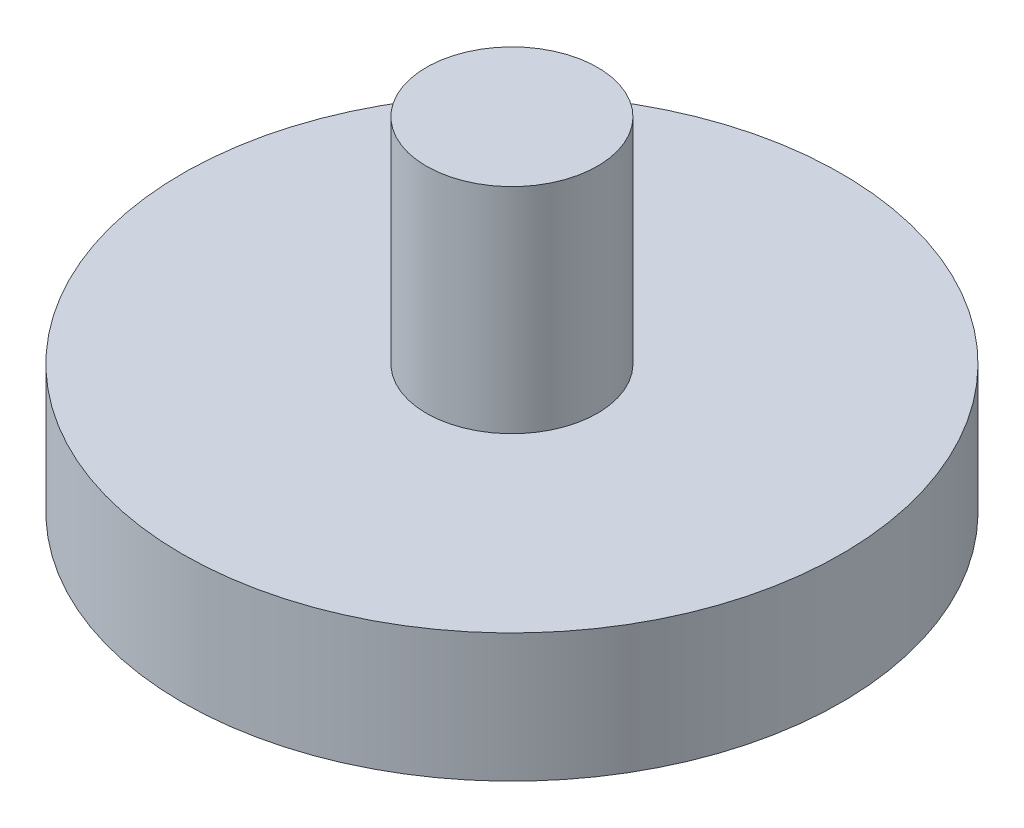
ISO-10303-21;
HEADER;
FILE_DESCRIPTION(('STEP AP214'),'2;1');
FILE_NAME('part.step','',(''),(''),'','','');
FILE_SCHEMA(('AUTOMOTIVE_DESIGN { 1 0 10303 214 1 1 1 1 }'));
ENDSEC;
DATA;
#1=APPLICATION_CONTEXT('core data for automotive mechanical design processes');
#2=APPLICATION_PROTOCOL_DEFINITION('international standard','automotive_design',2000,#1);
#3=PRODUCT_CONTEXT('',#1,'mechanical');
#4=PRODUCT('Part','Part','',(#3));
#5=PRODUCT_RELATED_PRODUCT_CATEGORY('part','',(#4));
#6=PRODUCT_DEFINITION_FORMATION('','',#4);
#7=PRODUCT_DEFINITION_CONTEXT('part definition',#1,'design');
#8=PRODUCT_DEFINITION('design','',#6,#7);
#9=PRODUCT_DEFINITION_SHAPE('','',#8);
#10=(LENGTH_UNIT() NAMED_UNIT(*) SI_UNIT(.MILLI.,.METRE.));
#11=(NAMED_UNIT(*) PLANE_ANGLE_UNIT() SI_UNIT($,.RADIAN.));
#12=(NAMED_UNIT(*) SI_UNIT($,.STERADIAN.) SOLID_ANGLE_UNIT());
#13=UNCERTAINTY_MEASURE_WITH_UNIT(LENGTH_MEASURE(1.E-05),#10,'distance_accuracy_value','');
#14=(GEOMETRIC_REPRESENTATION_CONTEXT(3) GLOBAL_UNCERTAINTY_ASSIGNED_CONTEXT((#13)) GLOBAL_UNIT_ASSIGNED_CONTEXT((#10,
#11,#12)) REPRESENTATION_CONTEXT('',''));
#15=CARTESIAN_POINT('',(0.,0.,0.));
#16=DIRECTION('',(0.,0.,1.));
#17=DIRECTION('',(1.,0.,0.));
#18=AXIS2_PLACEMENT_3D('',#15,#16,#17);
#19=CARTESIAN_POINT('',(0.,3.,0.));
#20=DIRECTION('',(0.,-1.,0.));
#21=DIRECTION('',(0.,0.,-1.));
#22=AXIS2_PLACEMENT_3D('',#19,#20,#21);
#23=CYLINDRICAL_SURFACE('',#22,7.7);
#24=CARTESIAN_POINT('',(0.,3.,0.));
#25=DIRECTION('',(0.,1.,0.));
#26=DIRECTION('',(0.,0.,1.));
#27=AXIS2_PLACEMENT_3D('',#24,#25,#26);
#28=CIRCLE('',#27,7.7);
#29=CARTESIAN_POINT('',(0.,3.,7.7));
#30=VERTEX_POINT('',#29);
#31=EDGE_CURVE('E39',#30,#30,#28,.T.);
#32=ORIENTED_EDGE('',*,*,#31,.F.);
#33=EDGE_LOOP('',(#32));
#34=FACE_BOUND('',#33,.T.);
#35=CARTESIAN_POINT('',(0.,0.,0.));
#36=DIRECTION('',(0.,1.,0.));
#37=DIRECTION('',(0.,0.,1.));
#38=AXIS2_PLACEMENT_3D('',#35,#36,#37);
#39=CIRCLE('',#38,7.7);
#40=CARTESIAN_POINT('',(0.,0.,7.7));
#41=VERTEX_POINT('',#40);
#42=EDGE_CURVE('E35',#41,#41,#39,.T.);
#43=ORIENTED_EDGE('',*,*,#42,.T.);
#44=EDGE_LOOP('',(#43));
#45=FACE_BOUND('',#44,.T.);
#46=ADVANCED_FACE('F32',(#34,#45),#23,.T.);
#47=CARTESIAN_POINT('',(0.,3.,0.));
#48=DIRECTION('',(0.,1.,0.));
#49=DIRECTION('',(0.,0.,1.));
#50=AXIS2_PLACEMENT_3D('',#47,#48,#49);
#51=PLANE('',#50);
#52=CARTESIAN_POINT('',(0.,3.,0.));
#53=DIRECTION('',(0.,1.,0.));
#54=DIRECTION('',(0.,0.,1.));
#55=AXIS2_PLACEMENT_3D('',#52,#53,#54);
#56=CIRCLE('',#55,2.);
#57=CARTESIAN_POINT('',(0.,3.,2.));
#58=VERTEX_POINT('',#57);
#59=EDGE_CURVE('E10',#58,#58,#56,.T.);
#60=ORIENTED_EDGE('',*,*,#59,.F.);
#61=EDGE_LOOP('',(#60));
#62=FACE_BOUND('',#61,.T.);
#63=ORIENTED_EDGE('',*,*,#31,.T.);
#64=EDGE_LOOP('',(#63));
#65=FACE_BOUND('',#64,.T.);
#66=ADVANCED_FACE('F68',(#62,#65),#51,.T.);
#67=CARTESIAN_POINT('',(0.,0.,0.));
#68=DIRECTION('',(0.,1.,0.));
#69=DIRECTION('',(0.,0.,1.));
#70=AXIS2_PLACEMENT_3D('',#67,#68,#69);
#71=PLANE('',#70);
#72=CARTESIAN_POINT('',(0.,0.,0.));
#73=DIRECTION('',(0.,-1.,0.));
#74=DIRECTION('',(0.,0.,-1.));
#75=AXIS2_PLACEMENT_3D('',#72,#73,#74);
#76=CIRCLE('',#75,1.5);
#77=CARTESIAN_POINT('',(0.,0.,-1.5));
#78=VERTEX_POINT('',#77);
#79=EDGE_CURVE('E49',#78,#78,#76,.T.);
#80=ORIENTED_EDGE('',*,*,#79,.F.);
#81=EDGE_LOOP('',(#80));
#82=FACE_BOUND('',#81,.T.);
#83=ORIENTED_EDGE('',*,*,#42,.F.);
#84=EDGE_LOOP('',(#83));
#85=FACE_BOUND('',#84,.T.);
#86=ADVANCED_FACE('F64',(#82,#85),#71,.F.);
#87=CARTESIAN_POINT('',(0.,8.,0.));
#88=DIRECTION('',(0.,-1.,0.));
#89=DIRECTION('',(0.,0.,-1.));
#90=AXIS2_PLACEMENT_3D('',#87,#88,#89);
#91=CYLINDRICAL_SURFACE('',#90,2.);
#92=CARTESIAN_POINT('',(0.,8.,0.));
#93=DIRECTION('',(0.,1.,0.));
#94=DIRECTION('',(0.,0.,1.));
#95=AXIS2_PLACEMENT_3D('',#92,#93,#94);
#96=CIRCLE('',#95,2.);
#97=CARTESIAN_POINT('',(0.,8.,2.));
#98=VERTEX_POINT('',#97);
#99=EDGE_CURVE('E45',#98,#98,#96,.T.);
#100=ORIENTED_EDGE('',*,*,#99,.F.);
#101=EDGE_LOOP('',(#100));
#102=FACE_BOUND('',#101,.T.);
#103=ORIENTED_EDGE('',*,*,#59,.T.);
#104=EDGE_LOOP('',(#103));
#105=FACE_BOUND('',#104,.T.);
#106=ADVANCED_FACE('F67',(#102,#105),#91,.T.);
#107=CARTESIAN_POINT('',(0.,8.,0.));
#108=DIRECTION('',(0.,1.,0.));
#109=DIRECTION('',(0.,0.,1.));
#110=AXIS2_PLACEMENT_3D('',#107,#108,#109);
#111=PLANE('',#110);
#112=ORIENTED_EDGE('',*,*,#99,.T.);
#113=EDGE_LOOP('',(#112));
#114=FACE_BOUND('',#113,.T.);
#115=ADVANCED_FACE('F60',(#114),#111,.T.);
#116=CARTESIAN_POINT('',(0.,5.,0.));
#117=DIRECTION('',(0.,-1.,0.));
#118=DIRECTION('',(0.,0.,-1.));
#119=AXIS2_PLACEMENT_3D('',#116,#117,#118);
#120=CYLINDRICAL_SURFACE('',#119,1.5);
#121=CARTESIAN_POINT('',(0.,5.,0.));
#122=DIRECTION('',(0.,-1.,0.));
#123=DIRECTION('',(0.,0.,-1.));
#124=AXIS2_PLACEMENT_3D('',#121,#122,#123);
#125=CIRCLE('',#124,1.5);
#126=CARTESIAN_POINT('',(0.,5.,-1.5));
#127=VERTEX_POINT('',#126);
#128=EDGE_CURVE('E48',#127,#127,#125,.T.);
#129=ORIENTED_EDGE('',*,*,#128,.F.);
#130=EDGE_LOOP('',(#129));
#131=FACE_BOUND('',#130,.T.);
#132=ORIENTED_EDGE('',*,*,#79,.T.);
#133=EDGE_LOOP('',(#132));
#134=FACE_BOUND('',#133,.T.);
#135=ADVANCED_FACE('F57',(#131,#134),#120,.F.);
#136=CARTESIAN_POINT('',(0.,5.,0.));
#137=DIRECTION('',(0.,-1.,0.));
#138=DIRECTION('',(0.,0.,-1.));
#139=AXIS2_PLACEMENT_3D('',#136,#137,#138);
#140=PLANE('',#139);
#141=ORIENTED_EDGE('',*,*,#128,.T.);
#142=EDGE_LOOP('',(#141));
#143=FACE_BOUND('',#142,.T.);
#144=ADVANCED_FACE('F55',(#143),#140,.T.);
#145=CLOSED_SHELL('',(#46,#66,#86,#106,#115,#135,#144));
#146=MANIFOLD_SOLID_BREP('B2',#145);
#147=ADVANCED_BREP_SHAPE_REPRESENTATION('',(#18,#146),#14);
#148=SHAPE_DEFINITION_REPRESENTATION(#9,#147);
ENDSEC;
END-ISO-10303-21;
